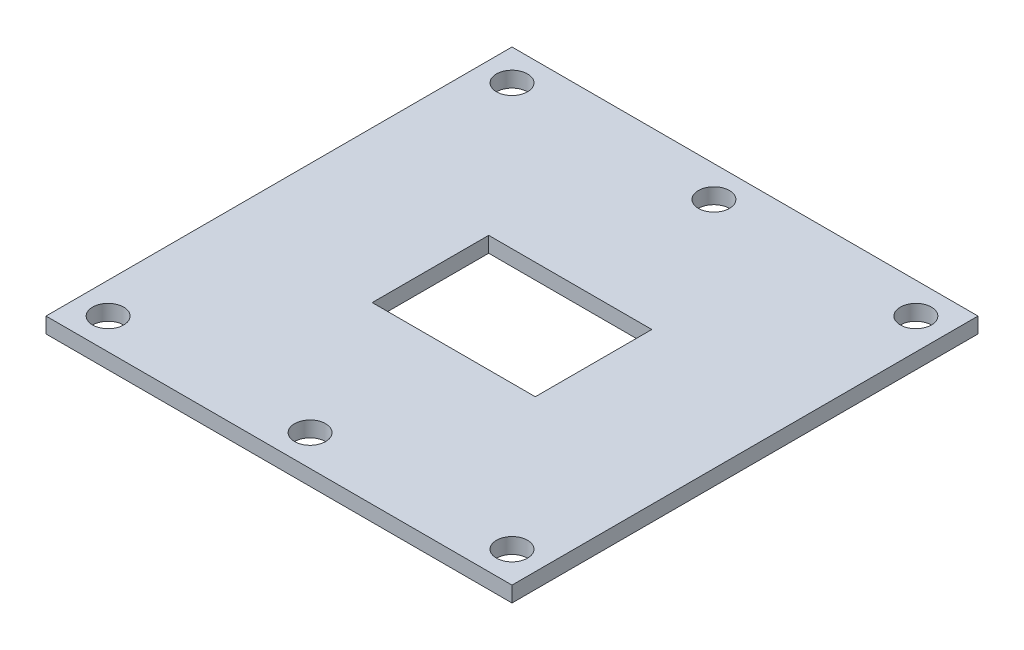
ISO-10303-21;
HEADER;
FILE_DESCRIPTION(('STEP AP214'),'2;1');
FILE_NAME('part.step','',(''),(''),'','','');
FILE_SCHEMA(('AUTOMOTIVE_DESIGN { 1 0 10303 214 1 1 1 1 }'));
ENDSEC;
DATA;
#1=APPLICATION_CONTEXT('core data for automotive mechanical design processes');
#2=APPLICATION_PROTOCOL_DEFINITION('international standard','automotive_design',2000,#1);
#3=PRODUCT_CONTEXT('',#1,'mechanical');
#4=PRODUCT('Part','Part','',(#3));
#5=PRODUCT_RELATED_PRODUCT_CATEGORY('part','',(#4));
#6=PRODUCT_DEFINITION_FORMATION('','',#4);
#7=PRODUCT_DEFINITION_CONTEXT('part definition',#1,'design');
#8=PRODUCT_DEFINITION('design','',#6,#7);
#9=PRODUCT_DEFINITION_SHAPE('','',#8);
#10=(LENGTH_UNIT() NAMED_UNIT(*) SI_UNIT(.MILLI.,.METRE.));
#11=(NAMED_UNIT(*) PLANE_ANGLE_UNIT() SI_UNIT($,.RADIAN.));
#12=(NAMED_UNIT(*) SI_UNIT($,.STERADIAN.) SOLID_ANGLE_UNIT());
#13=UNCERTAINTY_MEASURE_WITH_UNIT(LENGTH_MEASURE(1.E-05),#10,'distance_accuracy_value','');
#14=(GEOMETRIC_REPRESENTATION_CONTEXT(3) GLOBAL_UNCERTAINTY_ASSIGNED_CONTEXT((#13)) GLOBAL_UNIT_ASSIGNED_CONTEXT((#10,
#11,#12)) REPRESENTATION_CONTEXT('',''));
#15=CARTESIAN_POINT('',(0.,0.,0.));
#16=DIRECTION('',(0.,0.,1.));
#17=DIRECTION('',(1.,0.,0.));
#18=AXIS2_PLACEMENT_3D('',#15,#16,#17);
#19=CARTESIAN_POINT('',(-30.,2.,30.));
#20=DIRECTION('',(1.,0.,0.));
#21=DIRECTION('',(0.,0.,-1.));
#22=AXIS2_PLACEMENT_3D('',#19,#20,#21);
#23=PLANE('',#22);
#24=DIRECTION('',(0.,0.,1.));
#25=VECTOR('',#24,1.);
#26=CARTESIAN_POINT('',(-30.,0.,30.));
#27=LINE('',#26,#25);
#28=CARTESIAN_POINT('',(-30.,0.,-30.));
#29=VERTEX_POINT('',#28);
#30=CARTESIAN_POINT('',(-30.,0.,30.));
#31=VERTEX_POINT('',#30);
#32=EDGE_CURVE('E167',#29,#31,#27,.T.);
#33=ORIENTED_EDGE('',*,*,#32,.T.);
#34=DIRECTION('',(0.,-1.,0.));
#35=VECTOR('',#34,1.);
#36=CARTESIAN_POINT('',(-30.,2.,30.));
#37=LINE('',#36,#35);
#38=CARTESIAN_POINT('',(-30.,2.,30.));
#39=VERTEX_POINT('',#38);
#40=EDGE_CURVE('E11',#39,#31,#37,.T.);
#41=ORIENTED_EDGE('',*,*,#40,.F.);
#42=DIRECTION('',(0.,0.,1.));
#43=VECTOR('',#42,1.);
#44=CARTESIAN_POINT('',(-30.,2.,30.));
#45=LINE('',#44,#43);
#46=CARTESIAN_POINT('',(-30.,2.,-30.));
#47=VERTEX_POINT('',#46);
#48=EDGE_CURVE('E170',#47,#39,#45,.T.);
#49=ORIENTED_EDGE('',*,*,#48,.F.);
#50=DIRECTION('',(0.,-1.,0.));
#51=VECTOR('',#50,1.);
#52=CARTESIAN_POINT('',(-30.,2.,-30.));
#53=LINE('',#52,#51);
#54=EDGE_CURVE('E180',#47,#29,#53,.T.);
#55=ORIENTED_EDGE('',*,*,#54,.T.);
#56=EDGE_LOOP('',(#33,#41,#49,#55));
#57=FACE_BOUND('',#56,.T.);
#58=ADVANCED_FACE('F33',(#57),#23,.F.);
#59=CARTESIAN_POINT('',(30.,2.,30.));
#60=DIRECTION('',(0.,0.,-1.));
#61=DIRECTION('',(-1.,0.,0.));
#62=AXIS2_PLACEMENT_3D('',#59,#60,#61);
#63=PLANE('',#62);
#64=DIRECTION('',(1.,0.,0.));
#65=VECTOR('',#64,1.);
#66=CARTESIAN_POINT('',(30.,0.,30.));
#67=LINE('',#66,#65);
#68=CARTESIAN_POINT('',(30.,0.,30.));
#69=VERTEX_POINT('',#68);
#70=EDGE_CURVE('E183',#31,#69,#67,.T.);
#71=ORIENTED_EDGE('',*,*,#70,.T.);
#72=DIRECTION('',(0.,-1.,0.));
#73=VECTOR('',#72,1.);
#74=CARTESIAN_POINT('',(30.,2.,30.));
#75=LINE('',#74,#73);
#76=CARTESIAN_POINT('',(30.,2.,30.));
#77=VERTEX_POINT('',#76);
#78=EDGE_CURVE('E40',#77,#69,#75,.T.);
#79=ORIENTED_EDGE('',*,*,#78,.F.);
#80=DIRECTION('',(1.,0.,0.));
#81=VECTOR('',#80,1.);
#82=CARTESIAN_POINT('',(30.,2.,30.));
#83=LINE('',#82,#81);
#84=EDGE_CURVE('E173',#39,#77,#83,.T.);
#85=ORIENTED_EDGE('',*,*,#84,.F.);
#86=ORIENTED_EDGE('',*,*,#40,.T.);
#87=EDGE_LOOP('',(#71,#79,#85,#86));
#88=FACE_BOUND('',#87,.T.);
#89=ADVANCED_FACE('F212',(#88),#63,.F.);
#90=CARTESIAN_POINT('',(30.,2.,30.));
#91=DIRECTION('',(-1.,0.,0.));
#92=DIRECTION('',(0.,0.,1.));
#93=AXIS2_PLACEMENT_3D('',#90,#91,#92);
#94=PLANE('',#93);
#95=DIRECTION('',(0.,0.,-1.));
#96=VECTOR('',#95,1.);
#97=CARTESIAN_POINT('',(30.,0.,30.));
#98=LINE('',#97,#96);
#99=CARTESIAN_POINT('',(30.,0.,-30.));
#100=VERTEX_POINT('',#99);
#101=EDGE_CURVE('E185',#69,#100,#98,.T.);
#102=ORIENTED_EDGE('',*,*,#101,.T.);
#103=DIRECTION('',(0.,-1.,0.));
#104=VECTOR('',#103,1.);
#105=CARTESIAN_POINT('',(30.,2.,-30.));
#106=LINE('',#105,#104);
#107=CARTESIAN_POINT('',(30.,2.,-30.));
#108=VERTEX_POINT('',#107);
#109=EDGE_CURVE('E190',#108,#100,#106,.T.);
#110=ORIENTED_EDGE('',*,*,#109,.F.);
#111=DIRECTION('',(0.,0.,-1.));
#112=VECTOR('',#111,1.);
#113=CARTESIAN_POINT('',(30.,2.,30.));
#114=LINE('',#113,#112);
#115=EDGE_CURVE('E176',#77,#108,#114,.T.);
#116=ORIENTED_EDGE('',*,*,#115,.F.);
#117=ORIENTED_EDGE('',*,*,#78,.T.);
#118=EDGE_LOOP('',(#102,#110,#116,#117));
#119=FACE_BOUND('',#118,.T.);
#120=ADVANCED_FACE('F197',(#119),#94,.F.);
#121=CARTESIAN_POINT('',(30.,2.,-30.));
#122=DIRECTION('',(0.,0.,1.));
#123=DIRECTION('',(1.,0.,0.));
#124=AXIS2_PLACEMENT_3D('',#121,#122,#123);
#125=PLANE('',#124);
#126=DIRECTION('',(-1.,0.,0.));
#127=VECTOR('',#126,1.);
#128=CARTESIAN_POINT('',(30.,0.,-30.));
#129=LINE('',#128,#127);
#130=EDGE_CURVE('E174',#100,#29,#129,.T.);
#131=ORIENTED_EDGE('',*,*,#130,.T.);
#132=ORIENTED_EDGE('',*,*,#54,.F.);
#133=DIRECTION('',(-1.,0.,0.));
#134=VECTOR('',#133,1.);
#135=CARTESIAN_POINT('',(30.,2.,-30.));
#136=LINE('',#135,#134);
#137=EDGE_CURVE('E178',#108,#47,#136,.T.);
#138=ORIENTED_EDGE('',*,*,#137,.F.);
#139=ORIENTED_EDGE('',*,*,#109,.T.);
#140=EDGE_LOOP('',(#131,#132,#138,#139));
#141=FACE_BOUND('',#140,.T.);
#142=ADVANCED_FACE('F205',(#141),#125,.F.);
#143=CARTESIAN_POINT('',(0.,2.,0.));
#144=DIRECTION('',(0.,1.,0.));
#145=DIRECTION('',(0.,0.,1.));
#146=AXIS2_PLACEMENT_3D('',#143,#144,#145);
#147=PLANE('',#146);
#148=DIRECTION('',(0.,0.,1.));
#149=VECTOR('',#148,1.);
#150=CARTESIAN_POINT('',(-10.5,2.,7.5));
#151=LINE('',#150,#149);
#152=CARTESIAN_POINT('',(-10.5,2.,-7.5));
#153=VERTEX_POINT('',#152);
#154=CARTESIAN_POINT('',(-10.5,2.,7.5));
#155=VERTEX_POINT('',#154);
#156=EDGE_CURVE('E47',#153,#155,#151,.T.);
#157=ORIENTED_EDGE('',*,*,#156,.F.);
#158=DIRECTION('',(-1.,0.,0.));
#159=VECTOR('',#158,1.);
#160=CARTESIAN_POINT('',(10.5,2.,-7.5));
#161=LINE('',#160,#159);
#162=CARTESIAN_POINT('',(10.5,2.,-7.5));
#163=VERTEX_POINT('',#162);
#164=EDGE_CURVE('E115',#163,#153,#161,.T.);
#165=ORIENTED_EDGE('',*,*,#164,.F.);
#166=DIRECTION('',(0.,0.,-1.));
#167=VECTOR('',#166,1.);
#168=CARTESIAN_POINT('',(10.5,2.,7.5));
#169=LINE('',#168,#167);
#170=CARTESIAN_POINT('',(10.5,2.,7.5));
#171=VERTEX_POINT('',#170);
#172=EDGE_CURVE('E118',#171,#163,#169,.T.);
#173=ORIENTED_EDGE('',*,*,#172,.F.);
#174=DIRECTION('',(1.,0.,0.));
#175=VECTOR('',#174,1.);
#176=CARTESIAN_POINT('',(10.5,2.,7.5));
#177=LINE('',#176,#175);
#178=EDGE_CURVE('E124',#155,#171,#177,.T.);
#179=ORIENTED_EDGE('',*,*,#178,.F.);
#180=EDGE_LOOP('',(#157,#165,#173,#179));
#181=FACE_BOUND('',#180,.T.);
#182=CARTESIAN_POINT('',(-26.,2.,26.));
#183=DIRECTION('',(0.,1.,0.));
#184=DIRECTION('',(0.,0.,1.));
#185=AXIS2_PLACEMENT_3D('',#182,#183,#184);
#186=CIRCLE('',#185,2.);
#187=CARTESIAN_POINT('',(-26.,2.,28.));
#188=VERTEX_POINT('',#187);
#189=EDGE_CURVE('E130',#188,#188,#186,.T.);
#190=ORIENTED_EDGE('',*,*,#189,.F.);
#191=EDGE_LOOP('',(#190));
#192=FACE_BOUND('',#191,.T.);
#193=CARTESIAN_POINT('',(0.,2.,26.));
#194=DIRECTION('',(0.,1.,0.));
#195=DIRECTION('',(0.,0.,1.));
#196=AXIS2_PLACEMENT_3D('',#193,#194,#195);
#197=CIRCLE('',#196,2.);
#198=CARTESIAN_POINT('',(0.,2.,28.));
#199=VERTEX_POINT('',#198);
#200=EDGE_CURVE('E137',#199,#199,#197,.T.);
#201=ORIENTED_EDGE('',*,*,#200,.F.);
#202=EDGE_LOOP('',(#201));
#203=FACE_BOUND('',#202,.T.);
#204=CARTESIAN_POINT('',(26.,2.,26.));
#205=DIRECTION('',(0.,1.,0.));
#206=DIRECTION('',(0.,0.,1.));
#207=AXIS2_PLACEMENT_3D('',#204,#205,#206);
#208=CIRCLE('',#207,2.);
#209=CARTESIAN_POINT('',(26.,2.,28.));
#210=VERTEX_POINT('',#209);
#211=EDGE_CURVE('E143',#210,#210,#208,.T.);
#212=ORIENTED_EDGE('',*,*,#211,.F.);
#213=EDGE_LOOP('',(#212));
#214=FACE_BOUND('',#213,.T.);
#215=CARTESIAN_POINT('',(26.,2.,-26.));
#216=DIRECTION('',(0.,1.,0.));
#217=DIRECTION('',(0.,0.,1.));
#218=AXIS2_PLACEMENT_3D('',#215,#216,#217);
#219=CIRCLE('',#218,2.);
#220=CARTESIAN_POINT('',(26.,2.,-24.));
#221=VERTEX_POINT('',#220);
#222=EDGE_CURVE('E149',#221,#221,#219,.T.);
#223=ORIENTED_EDGE('',*,*,#222,.F.);
#224=EDGE_LOOP('',(#223));
#225=FACE_BOUND('',#224,.T.);
#226=CARTESIAN_POINT('',(0.,2.,-26.));
#227=DIRECTION('',(0.,1.,0.));
#228=DIRECTION('',(0.,0.,1.));
#229=AXIS2_PLACEMENT_3D('',#226,#227,#228);
#230=CIRCLE('',#229,2.);
#231=CARTESIAN_POINT('',(0.,2.,-24.));
#232=VERTEX_POINT('',#231);
#233=EDGE_CURVE('E155',#232,#232,#230,.T.);
#234=ORIENTED_EDGE('',*,*,#233,.F.);
#235=EDGE_LOOP('',(#234));
#236=FACE_BOUND('',#235,.T.);
#237=CARTESIAN_POINT('',(-26.,2.,-26.));
#238=DIRECTION('',(0.,1.,0.));
#239=DIRECTION('',(0.,0.,1.));
#240=AXIS2_PLACEMENT_3D('',#237,#238,#239);
#241=CIRCLE('',#240,2.);
#242=CARTESIAN_POINT('',(-26.,2.,-24.));
#243=VERTEX_POINT('',#242);
#244=EDGE_CURVE('E161',#243,#243,#241,.T.);
#245=ORIENTED_EDGE('',*,*,#244,.F.);
#246=EDGE_LOOP('',(#245));
#247=FACE_BOUND('',#246,.T.);
#248=ORIENTED_EDGE('',*,*,#48,.T.);
#249=ORIENTED_EDGE('',*,*,#84,.T.);
#250=ORIENTED_EDGE('',*,*,#115,.T.);
#251=ORIENTED_EDGE('',*,*,#137,.T.);
#252=EDGE_LOOP('',(#248,#249,#250,#251));
#253=FACE_BOUND('',#252,.T.);
#254=ADVANCED_FACE('F211',(#181,#192,#203,#214,#225,#236,#247,#253),#147,.T.);
#255=CARTESIAN_POINT('',(0.,0.,0.));
#256=DIRECTION('',(0.,1.,0.));
#257=DIRECTION('',(0.,0.,1.));
#258=AXIS2_PLACEMENT_3D('',#255,#256,#257);
#259=PLANE('',#258);
#260=DIRECTION('',(-1.,0.,0.));
#261=VECTOR('',#260,1.);
#262=CARTESIAN_POINT('',(10.5,0.,-7.5));
#263=LINE('',#262,#261);
#264=CARTESIAN_POINT('',(10.5,0.,-7.5));
#265=VERTEX_POINT('',#264);
#266=CARTESIAN_POINT('',(-10.5,0.,-7.5));
#267=VERTEX_POINT('',#266);
#268=EDGE_CURVE('E105',#265,#267,#263,.T.);
#269=ORIENTED_EDGE('',*,*,#268,.T.);
#270=DIRECTION('',(0.,0.,1.));
#271=VECTOR('',#270,1.);
#272=CARTESIAN_POINT('',(-10.5,0.,7.5));
#273=LINE('',#272,#271);
#274=CARTESIAN_POINT('',(-10.5,0.,7.5));
#275=VERTEX_POINT('',#274);
#276=EDGE_CURVE('E99',#267,#275,#273,.T.);
#277=ORIENTED_EDGE('',*,*,#276,.T.);
#278=DIRECTION('',(1.,0.,0.));
#279=VECTOR('',#278,1.);
#280=CARTESIAN_POINT('',(10.5,0.,7.5));
#281=LINE('',#280,#279);
#282=CARTESIAN_POINT('',(10.5,0.,7.5));
#283=VERTEX_POINT('',#282);
#284=EDGE_CURVE('E108',#275,#283,#281,.T.);
#285=ORIENTED_EDGE('',*,*,#284,.T.);
#286=DIRECTION('',(0.,0.,-1.));
#287=VECTOR('',#286,1.);
#288=CARTESIAN_POINT('',(10.5,0.,7.5));
#289=LINE('',#288,#287);
#290=EDGE_CURVE('E55',#283,#265,#289,.T.);
#291=ORIENTED_EDGE('',*,*,#290,.T.);
#292=EDGE_LOOP('',(#269,#277,#285,#291));
#293=FACE_BOUND('',#292,.T.);
#294=CARTESIAN_POINT('',(-26.,0.,26.));
#295=DIRECTION('',(0.,1.,0.));
#296=DIRECTION('',(0.,0.,1.));
#297=AXIS2_PLACEMENT_3D('',#294,#295,#296);
#298=CIRCLE('',#297,2.);
#299=CARTESIAN_POINT('',(-26.,0.,28.));
#300=VERTEX_POINT('',#299);
#301=EDGE_CURVE('E134',#300,#300,#298,.T.);
#302=ORIENTED_EDGE('',*,*,#301,.T.);
#303=EDGE_LOOP('',(#302));
#304=FACE_BOUND('',#303,.T.);
#305=CARTESIAN_POINT('',(0.,0.,26.));
#306=DIRECTION('',(0.,1.,0.));
#307=DIRECTION('',(0.,0.,1.));
#308=AXIS2_PLACEMENT_3D('',#305,#306,#307);
#309=CIRCLE('',#308,2.);
#310=CARTESIAN_POINT('',(0.,0.,28.));
#311=VERTEX_POINT('',#310);
#312=EDGE_CURVE('E140',#311,#311,#309,.T.);
#313=ORIENTED_EDGE('',*,*,#312,.T.);
#314=EDGE_LOOP('',(#313));
#315=FACE_BOUND('',#314,.T.);
#316=CARTESIAN_POINT('',(26.,0.,26.));
#317=DIRECTION('',(0.,1.,0.));
#318=DIRECTION('',(0.,0.,1.));
#319=AXIS2_PLACEMENT_3D('',#316,#317,#318);
#320=CIRCLE('',#319,2.);
#321=CARTESIAN_POINT('',(26.,0.,28.));
#322=VERTEX_POINT('',#321);
#323=EDGE_CURVE('E146',#322,#322,#320,.T.);
#324=ORIENTED_EDGE('',*,*,#323,.T.);
#325=EDGE_LOOP('',(#324));
#326=FACE_BOUND('',#325,.T.);
#327=CARTESIAN_POINT('',(26.,0.,-26.));
#328=DIRECTION('',(0.,1.,0.));
#329=DIRECTION('',(0.,0.,1.));
#330=AXIS2_PLACEMENT_3D('',#327,#328,#329);
#331=CIRCLE('',#330,2.);
#332=CARTESIAN_POINT('',(26.,0.,-24.));
#333=VERTEX_POINT('',#332);
#334=EDGE_CURVE('E152',#333,#333,#331,.T.);
#335=ORIENTED_EDGE('',*,*,#334,.T.);
#336=EDGE_LOOP('',(#335));
#337=FACE_BOUND('',#336,.T.);
#338=CARTESIAN_POINT('',(0.,0.,-26.));
#339=DIRECTION('',(0.,1.,0.));
#340=DIRECTION('',(0.,0.,1.));
#341=AXIS2_PLACEMENT_3D('',#338,#339,#340);
#342=CIRCLE('',#341,2.);
#343=CARTESIAN_POINT('',(0.,0.,-24.));
#344=VERTEX_POINT('',#343);
#345=EDGE_CURVE('E158',#344,#344,#342,.T.);
#346=ORIENTED_EDGE('',*,*,#345,.T.);
#347=EDGE_LOOP('',(#346));
#348=FACE_BOUND('',#347,.T.);
#349=CARTESIAN_POINT('',(-26.,0.,-26.));
#350=DIRECTION('',(0.,1.,0.));
#351=DIRECTION('',(0.,0.,1.));
#352=AXIS2_PLACEMENT_3D('',#349,#350,#351);
#353=CIRCLE('',#352,2.);
#354=CARTESIAN_POINT('',(-26.,0.,-24.));
#355=VERTEX_POINT('',#354);
#356=EDGE_CURVE('E164',#355,#355,#353,.T.);
#357=ORIENTED_EDGE('',*,*,#356,.T.);
#358=EDGE_LOOP('',(#357));
#359=FACE_BOUND('',#358,.T.);
#360=ORIENTED_EDGE('',*,*,#32,.F.);
#361=ORIENTED_EDGE('',*,*,#130,.F.);
#362=ORIENTED_EDGE('',*,*,#101,.F.);
#363=ORIENTED_EDGE('',*,*,#70,.F.);
#364=EDGE_LOOP('',(#360,#361,#362,#363));
#365=FACE_BOUND('',#364,.T.);
#366=ADVANCED_FACE('F112',(#293,#304,#315,#326,#337,#348,#359,#365),#259,.F.);
#367=CARTESIAN_POINT('',(-26.,0.,-26.));
#368=DIRECTION('',(0.,1.,0.));
#369=DIRECTION('',(0.,0.,1.));
#370=AXIS2_PLACEMENT_3D('',#367,#368,#369);
#371=CYLINDRICAL_SURFACE('',#370,2.);
#372=ORIENTED_EDGE('',*,*,#356,.F.);
#373=EDGE_LOOP('',(#372));
#374=FACE_BOUND('',#373,.T.);
#375=ORIENTED_EDGE('',*,*,#244,.T.);
#376=EDGE_LOOP('',(#375));
#377=FACE_BOUND('',#376,.T.);
#378=ADVANCED_FACE('F224',(#374,#377),#371,.F.);
#379=CARTESIAN_POINT('',(0.,0.,-26.));
#380=DIRECTION('',(0.,1.,0.));
#381=DIRECTION('',(0.,0.,1.));
#382=AXIS2_PLACEMENT_3D('',#379,#380,#381);
#383=CYLINDRICAL_SURFACE('',#382,2.);
#384=ORIENTED_EDGE('',*,*,#345,.F.);
#385=EDGE_LOOP('',(#384));
#386=FACE_BOUND('',#385,.T.);
#387=ORIENTED_EDGE('',*,*,#233,.T.);
#388=EDGE_LOOP('',(#387));
#389=FACE_BOUND('',#388,.T.);
#390=ADVANCED_FACE('F230',(#386,#389),#383,.F.);
#391=CARTESIAN_POINT('',(26.,0.,-26.));
#392=DIRECTION('',(0.,1.,0.));
#393=DIRECTION('',(0.,0.,1.));
#394=AXIS2_PLACEMENT_3D('',#391,#392,#393);
#395=CYLINDRICAL_SURFACE('',#394,2.);
#396=ORIENTED_EDGE('',*,*,#334,.F.);
#397=EDGE_LOOP('',(#396));
#398=FACE_BOUND('',#397,.T.);
#399=ORIENTED_EDGE('',*,*,#222,.T.);
#400=EDGE_LOOP('',(#399));
#401=FACE_BOUND('',#400,.T.);
#402=ADVANCED_FACE('F234',(#398,#401),#395,.F.);
#403=CARTESIAN_POINT('',(26.,0.,26.));
#404=DIRECTION('',(0.,1.,0.));
#405=DIRECTION('',(0.,0.,1.));
#406=AXIS2_PLACEMENT_3D('',#403,#404,#405);
#407=CYLINDRICAL_SURFACE('',#406,2.);
#408=ORIENTED_EDGE('',*,*,#323,.F.);
#409=EDGE_LOOP('',(#408));
#410=FACE_BOUND('',#409,.T.);
#411=ORIENTED_EDGE('',*,*,#211,.T.);
#412=EDGE_LOOP('',(#411));
#413=FACE_BOUND('',#412,.T.);
#414=ADVANCED_FACE('F238',(#410,#413),#407,.F.);
#415=CARTESIAN_POINT('',(0.,0.,26.));
#416=DIRECTION('',(0.,1.,0.));
#417=DIRECTION('',(0.,0.,1.));
#418=AXIS2_PLACEMENT_3D('',#415,#416,#417);
#419=CYLINDRICAL_SURFACE('',#418,2.);
#420=ORIENTED_EDGE('',*,*,#312,.F.);
#421=EDGE_LOOP('',(#420));
#422=FACE_BOUND('',#421,.T.);
#423=ORIENTED_EDGE('',*,*,#200,.T.);
#424=EDGE_LOOP('',(#423));
#425=FACE_BOUND('',#424,.T.);
#426=ADVANCED_FACE('F242',(#422,#425),#419,.F.);
#427=CARTESIAN_POINT('',(-26.,0.,26.));
#428=DIRECTION('',(0.,1.,0.));
#429=DIRECTION('',(0.,0.,1.));
#430=AXIS2_PLACEMENT_3D('',#427,#428,#429);
#431=CYLINDRICAL_SURFACE('',#430,2.);
#432=ORIENTED_EDGE('',*,*,#301,.F.);
#433=EDGE_LOOP('',(#432));
#434=FACE_BOUND('',#433,.T.);
#435=ORIENTED_EDGE('',*,*,#189,.T.);
#436=EDGE_LOOP('',(#435));
#437=FACE_BOUND('',#436,.T.);
#438=ADVANCED_FACE('F246',(#434,#437),#431,.F.);
#439=CARTESIAN_POINT('',(-10.5,0.,7.5));
#440=DIRECTION('',(-1.,0.,0.));
#441=DIRECTION('',(0.,0.,1.));
#442=AXIS2_PLACEMENT_3D('',#439,#440,#441);
#443=PLANE('',#442);
#444=ORIENTED_EDGE('',*,*,#156,.T.);
#445=DIRECTION('',(0.,1.,0.));
#446=VECTOR('',#445,1.);
#447=CARTESIAN_POINT('',(-10.5,0.,7.5));
#448=LINE('',#447,#446);
#449=EDGE_CURVE('E95',#275,#155,#448,.T.);
#450=ORIENTED_EDGE('',*,*,#449,.F.);
#451=ORIENTED_EDGE('',*,*,#276,.F.);
#452=DIRECTION('',(0.,1.,0.));
#453=VECTOR('',#452,1.);
#454=CARTESIAN_POINT('',(-10.5,0.,-7.5));
#455=LINE('',#454,#453);
#456=EDGE_CURVE('E128',#267,#153,#455,.T.);
#457=ORIENTED_EDGE('',*,*,#456,.T.);
#458=EDGE_LOOP('',(#444,#450,#451,#457));
#459=FACE_BOUND('',#458,.T.);
#460=ADVANCED_FACE('F97',(#459),#443,.F.);
#461=CARTESIAN_POINT('',(10.5,0.,-7.5));
#462=DIRECTION('',(0.,0.,-1.));
#463=DIRECTION('',(-1.,0.,0.));
#464=AXIS2_PLACEMENT_3D('',#461,#462,#463);
#465=PLANE('',#464);
#466=ORIENTED_EDGE('',*,*,#164,.T.);
#467=ORIENTED_EDGE('',*,*,#456,.F.);
#468=ORIENTED_EDGE('',*,*,#268,.F.);
#469=DIRECTION('',(0.,1.,0.));
#470=VECTOR('',#469,1.);
#471=CARTESIAN_POINT('',(10.5,0.,-7.5));
#472=LINE('',#471,#470);
#473=EDGE_CURVE('E131',#265,#163,#472,.T.);
#474=ORIENTED_EDGE('',*,*,#473,.T.);
#475=EDGE_LOOP('',(#466,#467,#468,#474));
#476=FACE_BOUND('',#475,.T.);
#477=ADVANCED_FACE('F253',(#476),#465,.F.);
#478=CARTESIAN_POINT('',(10.5,0.,7.5));
#479=DIRECTION('',(1.,0.,0.));
#480=DIRECTION('',(0.,0.,-1.));
#481=AXIS2_PLACEMENT_3D('',#478,#479,#480);
#482=PLANE('',#481);
#483=ORIENTED_EDGE('',*,*,#172,.T.);
#484=ORIENTED_EDGE('',*,*,#473,.F.);
#485=ORIENTED_EDGE('',*,*,#290,.F.);
#486=DIRECTION('',(0.,1.,0.));
#487=VECTOR('',#486,1.);
#488=CARTESIAN_POINT('',(10.5,0.,7.5));
#489=LINE('',#488,#487);
#490=EDGE_CURVE('E104',#283,#171,#489,.T.);
#491=ORIENTED_EDGE('',*,*,#490,.T.);
#492=EDGE_LOOP('',(#483,#484,#485,#491));
#493=FACE_BOUND('',#492,.T.);
#494=ADVANCED_FACE('F256',(#493),#482,.F.);
#495=CARTESIAN_POINT('',(10.5,0.,7.5));
#496=DIRECTION('',(0.,0.,1.));
#497=DIRECTION('',(1.,0.,0.));
#498=AXIS2_PLACEMENT_3D('',#495,#496,#497);
#499=PLANE('',#498);
#500=ORIENTED_EDGE('',*,*,#178,.T.);
#501=ORIENTED_EDGE('',*,*,#490,.F.);
#502=ORIENTED_EDGE('',*,*,#284,.F.);
#503=ORIENTED_EDGE('',*,*,#449,.T.);
#504=EDGE_LOOP('',(#500,#501,#502,#503));
#505=FACE_BOUND('',#504,.T.);
#506=ADVANCED_FACE('F109',(#505),#499,.F.);
#507=CLOSED_SHELL('',(#58,#89,#120,#142,#254,#366,#378,#390,#402,#414,#426,#438,#460,#477,#494,#506));
#508=MANIFOLD_SOLID_BREP('B2',#507);
#509=ADVANCED_BREP_SHAPE_REPRESENTATION('',(#18,#508),#14);
#510=SHAPE_DEFINITION_REPRESENTATION(#9,#509);
ENDSEC;
END-ISO-10303-21;
